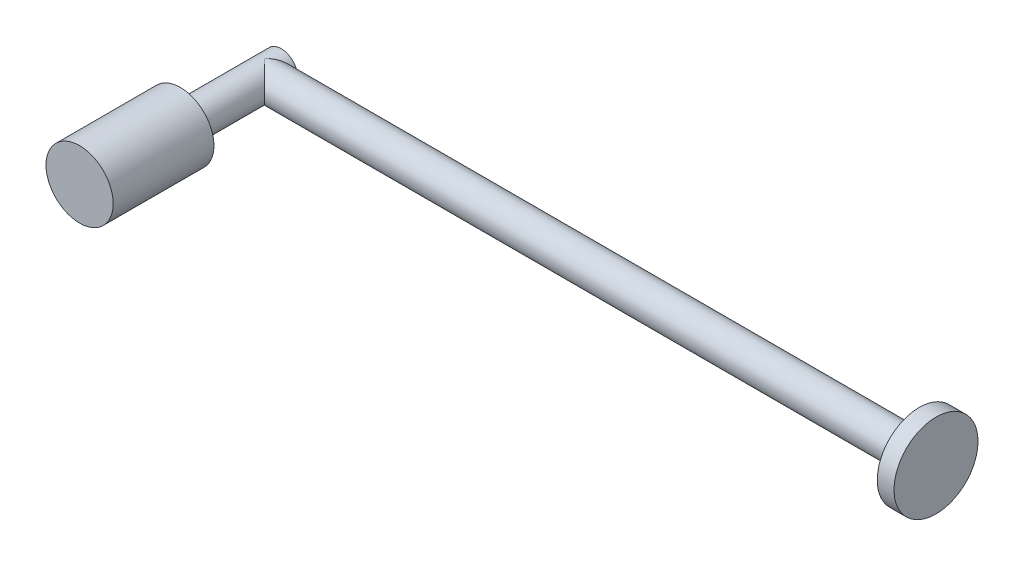
ISO-10303-21;
HEADER;
FILE_DESCRIPTION(('STEP AP214'),'2;1');
FILE_NAME('part.step','',(''),(''),'','','');
FILE_SCHEMA(('AUTOMOTIVE_DESIGN { 1 0 10303 214 1 1 1 1 }'));
ENDSEC;
DATA;
#1=APPLICATION_CONTEXT('core data for automotive mechanical design processes');
#2=APPLICATION_PROTOCOL_DEFINITION('international standard','automotive_design',2000,#1);
#3=PRODUCT_CONTEXT('',#1,'mechanical');
#4=PRODUCT('Part','Part','',(#3));
#5=PRODUCT_RELATED_PRODUCT_CATEGORY('part','',(#4));
#6=PRODUCT_DEFINITION_FORMATION('','',#4);
#7=PRODUCT_DEFINITION_CONTEXT('part definition',#1,'design');
#8=PRODUCT_DEFINITION('design','',#6,#7);
#9=PRODUCT_DEFINITION_SHAPE('','',#8);
#10=(LENGTH_UNIT() NAMED_UNIT(*) SI_UNIT(.MILLI.,.METRE.));
#11=(NAMED_UNIT(*) PLANE_ANGLE_UNIT() SI_UNIT($,.RADIAN.));
#12=(NAMED_UNIT(*) SI_UNIT($,.STERADIAN.) SOLID_ANGLE_UNIT());
#13=UNCERTAINTY_MEASURE_WITH_UNIT(LENGTH_MEASURE(1.E-05),#10,'distance_accuracy_value','');
#14=(GEOMETRIC_REPRESENTATION_CONTEXT(3) GLOBAL_UNCERTAINTY_ASSIGNED_CONTEXT((#13)) GLOBAL_UNIT_ASSIGNED_CONTEXT((#10,
#11,#12)) REPRESENTATION_CONTEXT('',''));
#15=CARTESIAN_POINT('',(0.,0.,0.));
#16=DIRECTION('',(0.,0.,1.));
#17=DIRECTION('',(1.,0.,0.));
#18=AXIS2_PLACEMENT_3D('',#15,#16,#17);
#19=CARTESIAN_POINT('',(40.,0.,-5.));
#20=DIRECTION('',(-1.,0.,0.));
#21=DIRECTION('',(0.,0.,1.));
#22=AXIS2_PLACEMENT_3D('',#19,#20,#21);
#23=CYLINDRICAL_SURFACE('',#22,1.);
#24=CARTESIAN_POINT('',(0.,0.,-5.));
#25=DIRECTION('',(-0.707106781186548,0.,-0.707106781186548));
#26=DIRECTION('',(0.707106781186548,0.,-0.707106781186548));
#27=AXIS2_PLACEMENT_3D('',#24,#25,#26);
#28=ELLIPSE('',#27,1.41421356237309,1.);
#29=CARTESIAN_POINT('',(0.,1.,-5.));
#30=VERTEX_POINT('',#29);
#31=CARTESIAN_POINT('',(1.,0.,-6.));
#32=VERTEX_POINT('',#31);
#33=EDGE_CURVE('E31',#30,#32,#28,.T.);
#34=ORIENTED_EDGE('',*,*,#33,.F.);
#35=CARTESIAN_POINT('',(0.,0.,-5.));
#36=DIRECTION('',(0.707106781186548,0.,-0.707106781186548));
#37=DIRECTION('',(-0.707106781186548,0.,-0.707106781186548));
#38=AXIS2_PLACEMENT_3D('',#35,#36,#37);
#39=ELLIPSE('',#38,1.41421356237309,1.);
#40=CARTESIAN_POINT('',(0.,-1.,-5.));
#41=VERTEX_POINT('',#40);
#42=EDGE_CURVE('E37',#41,#30,#39,.F.);
#43=ORIENTED_EDGE('',*,*,#42,.F.);
#44=EDGE_CURVE('E35',#32,#41,#28,.T.);
#45=ORIENTED_EDGE('',*,*,#44,.F.);
#46=EDGE_LOOP('',(#34,#43,#45));
#47=FACE_BOUND('',#46,.T.);
#48=CARTESIAN_POINT('',(39.,0.,-5.));
#49=DIRECTION('',(1.,0.,0.));
#50=DIRECTION('',(0.,0.,-1.));
#51=AXIS2_PLACEMENT_3D('',#48,#49,#50);
#52=CIRCLE('',#51,1.);
#53=CARTESIAN_POINT('',(39.,0.,-6.));
#54=VERTEX_POINT('',#53);
#55=EDGE_CURVE('E11',#54,#54,#52,.T.);
#56=ORIENTED_EDGE('',*,*,#55,.F.);
#57=EDGE_LOOP('',(#56));
#58=FACE_BOUND('',#57,.T.);
#59=ADVANCED_FACE('F16',(#47,#58),#23,.T.);
#60=CARTESIAN_POINT('',(0.,0.,0.));
#61=DIRECTION('',(0.,0.,-1.));
#62=DIRECTION('',(-1.,0.,0.));
#63=AXIS2_PLACEMENT_3D('',#60,#61,#62);
#64=CYLINDRICAL_SURFACE('',#63,1.);
#65=CARTESIAN_POINT('',(0.,0.,0.));
#66=DIRECTION('',(0.,0.,-1.));
#67=DIRECTION('',(-1.,0.,0.));
#68=AXIS2_PLACEMENT_3D('',#65,#66,#67);
#69=CIRCLE('',#68,1.);
#70=CARTESIAN_POINT('',(-1.,0.,0.));
#71=VERTEX_POINT('',#70);
#72=EDGE_CURVE('E51',#71,#71,#69,.T.);
#73=ORIENTED_EDGE('',*,*,#72,.T.);
#74=EDGE_LOOP('',(#73));
#75=FACE_BOUND('',#74,.T.);
#76=ORIENTED_EDGE('',*,*,#42,.T.);
#77=ORIENTED_EDGE('',*,*,#33,.T.);
#78=CARTESIAN_POINT('',(0.,0.,-6.));
#79=DIRECTION('',(0.,0.,-1.));
#80=DIRECTION('',(-1.,0.,0.));
#81=AXIS2_PLACEMENT_3D('',#78,#79,#80);
#82=CIRCLE('',#81,1.);
#83=EDGE_CURVE('E44',#32,#32,#82,.T.);
#84=ORIENTED_EDGE('',*,*,#83,.F.);
#85=ORIENTED_EDGE('',*,*,#44,.T.);
#86=EDGE_LOOP('',(#76,#77,#84,#85));
#87=FACE_BOUND('',#86,.T.);
#88=ADVANCED_FACE('F42',(#75,#87),#64,.T.);
#89=CARTESIAN_POINT('',(0.,0.,6.));
#90=DIRECTION('',(0.,0.,-1.));
#91=DIRECTION('',(-1.,0.,0.));
#92=AXIS2_PLACEMENT_3D('',#89,#90,#91);
#93=CYLINDRICAL_SURFACE('',#92,2.);
#94=CARTESIAN_POINT('',(0.,0.,6.));
#95=DIRECTION('',(0.,0.,1.));
#96=DIRECTION('',(1.,0.,0.));
#97=AXIS2_PLACEMENT_3D('',#94,#95,#96);
#98=CIRCLE('',#97,2.);
#99=CARTESIAN_POINT('',(2.,0.,6.));
#100=VERTEX_POINT('',#99);
#101=EDGE_CURVE('E24',#100,#100,#98,.T.);
#102=ORIENTED_EDGE('',*,*,#101,.F.);
#103=EDGE_LOOP('',(#102));
#104=FACE_BOUND('',#103,.T.);
#105=CARTESIAN_POINT('',(0.,0.,0.));
#106=DIRECTION('',(0.,0.,-1.));
#107=DIRECTION('',(-1.,0.,0.));
#108=AXIS2_PLACEMENT_3D('',#105,#106,#107);
#109=CIRCLE('',#108,2.);
#110=CARTESIAN_POINT('',(-2.,0.,0.));
#111=VERTEX_POINT('',#110);
#112=EDGE_CURVE('E55',#111,#111,#109,.T.);
#113=ORIENTED_EDGE('',*,*,#112,.F.);
#114=EDGE_LOOP('',(#113));
#115=FACE_BOUND('',#114,.T.);
#116=ADVANCED_FACE('F18',(#104,#115),#93,.T.);
#117=CARTESIAN_POINT('',(0.,0.,6.));
#118=DIRECTION('',(0.,0.,1.));
#119=DIRECTION('',(1.,0.,0.));
#120=AXIS2_PLACEMENT_3D('',#117,#118,#119);
#121=PLANE('',#120);
#122=ORIENTED_EDGE('',*,*,#101,.T.);
#123=EDGE_LOOP('',(#122));
#124=FACE_BOUND('',#123,.T.);
#125=ADVANCED_FACE('F65',(#124),#121,.T.);
#126=CARTESIAN_POINT('',(0.,0.,0.));
#127=DIRECTION('',(0.,0.,-1.));
#128=DIRECTION('',(-1.,0.,0.));
#129=AXIS2_PLACEMENT_3D('',#126,#127,#128);
#130=PLANE('',#129);
#131=ORIENTED_EDGE('',*,*,#72,.F.);
#132=EDGE_LOOP('',(#131));
#133=FACE_BOUND('',#132,.T.);
#134=ORIENTED_EDGE('',*,*,#112,.T.);
#135=EDGE_LOOP('',(#134));
#136=FACE_BOUND('',#135,.T.);
#137=ADVANCED_FACE('F62',(#133,#136),#130,.T.);
#138=CARTESIAN_POINT('',(0.,0.,-6.));
#139=DIRECTION('',(0.,0.,1.));
#140=DIRECTION('',(1.,0.,0.));
#141=AXIS2_PLACEMENT_3D('',#138,#139,#140);
#142=PLANE('',#141);
#143=ORIENTED_EDGE('',*,*,#83,.T.);
#144=EDGE_LOOP('',(#143));
#145=FACE_BOUND('',#144,.T.);
#146=ADVANCED_FACE('F86',(#145),#142,.F.);
#147=CARTESIAN_POINT('',(39.,0.,-5.));
#148=DIRECTION('',(1.,0.,0.));
#149=DIRECTION('',(0.,0.,-1.));
#150=AXIS2_PLACEMENT_3D('',#147,#148,#149);
#151=PLANE('',#150);
#152=CARTESIAN_POINT('',(39.,0.,-5.));
#153=DIRECTION('',(1.,0.,0.));
#154=DIRECTION('',(0.,0.,-1.));
#155=AXIS2_PLACEMENT_3D('',#152,#153,#154);
#156=CIRCLE('',#155,2.5);
#157=CARTESIAN_POINT('',(39.,0.,-7.5));
#158=VERTEX_POINT('',#157);
#159=EDGE_CURVE('E45',#158,#158,#156,.T.);
#160=ORIENTED_EDGE('',*,*,#159,.F.);
#161=EDGE_LOOP('',(#160));
#162=FACE_BOUND('',#161,.T.);
#163=ORIENTED_EDGE('',*,*,#55,.T.);
#164=EDGE_LOOP('',(#163));
#165=FACE_BOUND('',#164,.T.);
#166=ADVANCED_FACE('F89',(#162,#165),#151,.F.);
#167=CARTESIAN_POINT('',(39.,0.,-5.));
#168=DIRECTION('',(1.,0.,0.));
#169=DIRECTION('',(0.,0.,-1.));
#170=AXIS2_PLACEMENT_3D('',#167,#168,#169);
#171=CYLINDRICAL_SURFACE('',#170,2.5);
#172=ORIENTED_EDGE('',*,*,#159,.T.);
#173=EDGE_LOOP('',(#172));
#174=FACE_BOUND('',#173,.T.);
#175=CARTESIAN_POINT('',(40.,0.,-5.));
#176=DIRECTION('',(1.,0.,0.));
#177=DIRECTION('',(0.,0.,-1.));
#178=AXIS2_PLACEMENT_3D('',#175,#176,#177);
#179=CIRCLE('',#178,2.5);
#180=CARTESIAN_POINT('',(40.,0.,-7.5));
#181=VERTEX_POINT('',#180);
#182=EDGE_CURVE('E48',#181,#181,#179,.T.);
#183=ORIENTED_EDGE('',*,*,#182,.F.);
#184=EDGE_LOOP('',(#183));
#185=FACE_BOUND('',#184,.T.);
#186=ADVANCED_FACE('F93',(#174,#185),#171,.T.);
#187=CARTESIAN_POINT('',(40.,0.,-5.));
#188=DIRECTION('',(1.,0.,0.));
#189=DIRECTION('',(0.,0.,-1.));
#190=AXIS2_PLACEMENT_3D('',#187,#188,#189);
#191=PLANE('',#190);
#192=ORIENTED_EDGE('',*,*,#182,.T.);
#193=EDGE_LOOP('',(#192));
#194=FACE_BOUND('',#193,.T.);
#195=ADVANCED_FACE('F82',(#194),#191,.T.);
#196=CLOSED_SHELL('',(#59,#88,#116,#125,#137,#146,#166,#186,#195));
#197=MANIFOLD_SOLID_BREP('B1',#196);
#198=ADVANCED_BREP_SHAPE_REPRESENTATION('',(#18,#197),#14);
#199=SHAPE_DEFINITION_REPRESENTATION(#9,#198);
ENDSEC;
END-ISO-10303-21;
